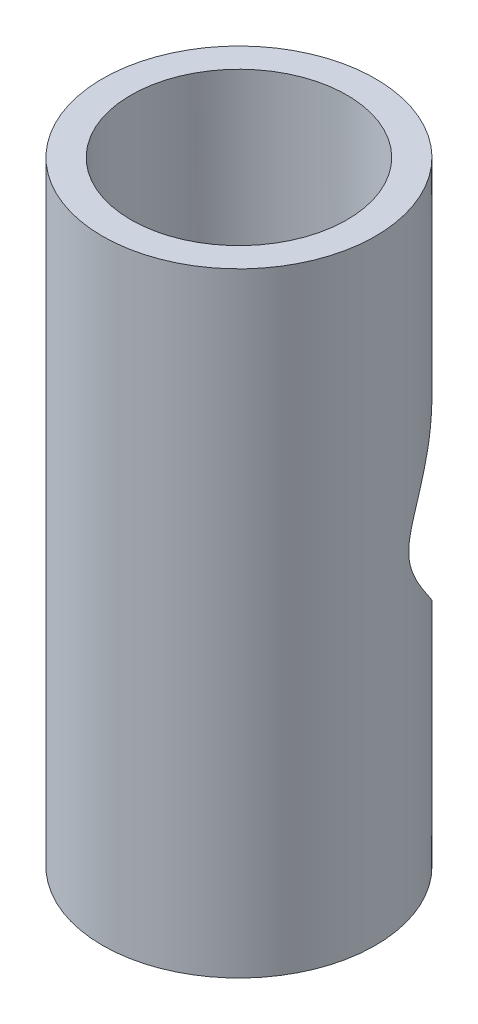
ISO-10303-21;
HEADER;
FILE_DESCRIPTION(('STEP AP214'),'2;1');
FILE_NAME('part.step','',(''),(''),'','','');
FILE_SCHEMA(('AUTOMOTIVE_DESIGN { 1 0 10303 214 1 1 1 1 }'));
ENDSEC;
DATA;
#1=APPLICATION_CONTEXT('core data for automotive mechanical design processes');
#2=APPLICATION_PROTOCOL_DEFINITION('international standard','automotive_design',2000,#1);
#3=PRODUCT_CONTEXT('',#1,'mechanical');
#4=PRODUCT('Part','Part','',(#3));
#5=PRODUCT_RELATED_PRODUCT_CATEGORY('part','',(#4));
#6=PRODUCT_DEFINITION_FORMATION('','',#4);
#7=PRODUCT_DEFINITION_CONTEXT('part definition',#1,'design');
#8=PRODUCT_DEFINITION('design','',#6,#7);
#9=PRODUCT_DEFINITION_SHAPE('','',#8);
#10=(LENGTH_UNIT() NAMED_UNIT(*) SI_UNIT(.MILLI.,.METRE.));
#11=(NAMED_UNIT(*) PLANE_ANGLE_UNIT() SI_UNIT($,.RADIAN.));
#12=(NAMED_UNIT(*) SI_UNIT($,.STERADIAN.) SOLID_ANGLE_UNIT());
#13=UNCERTAINTY_MEASURE_WITH_UNIT(LENGTH_MEASURE(1.E-05),#10,'distance_accuracy_value','');
#14=(GEOMETRIC_REPRESENTATION_CONTEXT(3) GLOBAL_UNCERTAINTY_ASSIGNED_CONTEXT((#13)) GLOBAL_UNIT_ASSIGNED_CONTEXT((#10,
#11,#12)) REPRESENTATION_CONTEXT('',''));
#15=CARTESIAN_POINT('',(0.,0.,0.));
#16=DIRECTION('',(0.,0.,1.));
#17=DIRECTION('',(1.,0.,0.));
#18=AXIS2_PLACEMENT_3D('',#15,#16,#17);
#19=CARTESIAN_POINT('',(0.,35.56,0.));
#20=DIRECTION('',(0.,0.,1.));
#21=DIRECTION('',(1.,0.,0.));
#22=AXIS2_PLACEMENT_3D('',#19,#20,#21);
#23=PLANE('',#22);
#24=CARTESIAN_POINT('',(0.,35.56,0.));
#25=DIRECTION('',(0.,0.,1.));
#26=DIRECTION('',(1.,0.,0.));
#27=AXIS2_PLACEMENT_3D('',#24,#25,#26);
#28=CIRCLE('',#27,14.605);
#29=CARTESIAN_POINT('',(12.065,27.329459313022,0.));
#30=VERTEX_POINT('',#29);
#31=CARTESIAN_POINT('',(12.065,43.790540686978,0.));
#32=VERTEX_POINT('',#31);
#33=EDGE_CURVE('E69',#30,#32,#28,.T.);
#34=ORIENTED_EDGE('',*,*,#33,.F.);
#35=DIRECTION('',(0.,1.,0.));
#36=VECTOR('',#35,1.);
#37=CARTESIAN_POINT('',(12.065,0.,0.));
#38=LINE('',#37,#36);
#39=EDGE_CURVE('E11',#30,#32,#38,.T.);
#40=ORIENTED_EDGE('',*,*,#39,.T.);
#41=EDGE_LOOP('',(#34,#40));
#42=FACE_BOUND('',#41,.T.);
#43=ADVANCED_FACE('F33',(#42),#23,.F.);
#44=CARTESIAN_POINT('',(0.,68.58,0.));
#45=DIRECTION('',(0.,-1.,0.));
#46=DIRECTION('',(0.,0.,-1.));
#47=AXIS2_PLACEMENT_3D('',#44,#45,#46);
#48=CYLINDRICAL_SURFACE('',#47,15.24);
#49=CARTESIAN_POINT('',(0.,50.165,-15.24));
#50=CARTESIAN_POINT('',(-0.33093358996792,50.1650006114282,-15.2400006098955));
#51=CARTESIAN_POINT('',(-0.661859114392725,50.1537321546418,-15.2292006371902));
#52=CARTESIAN_POINT('',(-1.32092860077811,50.1088938920169,-15.1862387463761));
#53=CARTESIAN_POINT('',(-1.6490713625311,50.0753149143057,-15.1540680427442));
#54=CARTESIAN_POINT('',(-2.3001816030391,49.9864801460235,-15.068999328301));
#55=CARTESIAN_POINT('',(-2.6231403970261,49.9311912739955,-15.0160696852406));
#56=CARTESIAN_POINT('',(-3.26090561073552,49.8000320933619,-14.8905918231387));
#57=CARTESIAN_POINT('',(-3.57571266261761,49.7241633859704,-14.8180451304031));
#58=CARTESIAN_POINT('',(-4.19302290448416,49.5537991184534,-14.6552843789313));
#59=CARTESIAN_POINT('',(-4.49559633720504,49.4594365229212,-14.5651964638999));
#60=CARTESIAN_POINT('',(-5.08918099996898,49.2532462643138,-14.3685631154736));
#61=CARTESIAN_POINT('',(-5.38019227015086,49.1414186618762,-14.2620177392181));
#62=CARTESIAN_POINT('',(-5.9494742292775,48.9018567148672,-14.034078405165));
#63=CARTESIAN_POINT('',(-6.22774707206366,48.7741250730736,-13.9126869704111));
#64=CARTESIAN_POINT('',(-6.77088193187832,48.5042338975543,-13.6566083422546));
#65=CARTESIAN_POINT('',(-7.03574083314454,48.3620710346042,-13.5219180810636));
#66=CARTESIAN_POINT('',(-7.65687437964201,48.0040358220291,-13.183358800626));
#67=CARTESIAN_POINT('',(-8.0063284355912,47.7817647509089,-12.9736953166482));
#68=CARTESIAN_POINT('',(-8.67712748313469,47.3150239977067,-12.5349835729407));
#69=CARTESIAN_POINT('',(-8.99846220972646,47.0705462748791,-12.3059282937458));
#70=CARTESIAN_POINT('',(-9.61385136234583,46.5618033257553,-11.8314324649711));
#71=CARTESIAN_POINT('',(-9.90783328059354,46.2974886842142,-11.5859511736049));
#72=CARTESIAN_POINT('',(-10.4680150205251,45.7521292294153,-11.0824234045809));
#73=CARTESIAN_POINT('',(-10.7342166822238,45.4710855261393,-10.8243777607807));
#74=CARTESIAN_POINT('',(-11.3226940237267,44.799182306733,-10.2121966169595));
#75=CARTESIAN_POINT('',(-11.6346181537817,44.4026049906728,-9.85436998927306));
#76=CARTESIAN_POINT('',(-12.2125302324538,43.5856377822277,-9.12835672832352));
#77=CARTESIAN_POINT('',(-12.4784863644511,43.1652316619513,-8.76016312294455));
#78=CARTESIAN_POINT('',(-12.8436329620918,42.5176069675765,-8.20655571719757));
#79=CARTESIAN_POINT('',(-12.9596524825016,42.2990443845405,-8.02192138759902));
#80=CARTESIAN_POINT('',(-13.1806591923973,41.8558397937468,-7.65336188136278));
#81=CARTESIAN_POINT('',(-13.2856475239992,41.6311984183922,-7.46943663321343));
#82=CARTESIAN_POINT('',(-13.484577984805,41.1755088272747,-7.10401272646018));
#83=CARTESIAN_POINT('',(-13.5785295660793,40.9444663062888,-6.92251211119802));
#84=CARTESIAN_POINT('',(-13.7554527822779,40.4749273176955,-6.56391844355129));
#85=CARTESIAN_POINT('',(-13.8384270848123,40.2364326785213,-6.38682432885911));
#86=CARTESIAN_POINT('',(-13.968559887674,39.8279627126289,-6.0953831887405));
#87=CARTESIAN_POINT('',(-14.0187054447384,39.6603729593842,-5.97902537089999));
#88=CARTESIAN_POINT('',(-14.1137010665404,39.3204033323164,-5.75119644853618));
#89=CARTESIAN_POINT('',(-14.158550910707,39.1480232593415,-5.63972554767859));
#90=CARTESIAN_POINT('',(-14.2427194724753,38.7978056740706,-5.42364828886364));
#91=CARTESIAN_POINT('',(-14.2820416426831,38.619971653659,-5.31903766793143));
#92=CARTESIAN_POINT('',(-14.3548362598628,38.257920672522,-5.11933500692725));
#93=CARTESIAN_POINT('',(-14.388310447351,38.073705630586,-5.02424013832465));
#94=CARTESIAN_POINT('',(-14.4606195166057,37.6254611447692,-4.812978036404));
#95=CARTESIAN_POINT('',(-14.4965526490508,37.3580203000021,-4.70280335608441));
#96=CARTESIAN_POINT('',(-14.5541023964824,36.8088707236599,-4.52161206344641));
#97=CARTESIAN_POINT('',(-14.5757639535185,36.527209817885,-4.45047264617915));
#98=CARTESIAN_POINT('',(-14.6004202004354,35.9986307750413,-4.3688633979901));
#99=CARTESIAN_POINT('',(-14.6057815696799,35.7530669527467,-4.35071915197012));
#100=CARTESIAN_POINT('',(-14.6040322655183,35.2626464919439,-4.35658672961078));
#101=CARTESIAN_POINT('',(-14.5969264292863,35.0177896160652,-4.38058220340708));
#102=CARTESIAN_POINT('',(-14.567127686787,34.4628842654013,-4.47878706769452));
#103=CARTESIAN_POINT('',(-14.5403843680251,34.1554155872073,-4.56594474087744));
#104=CARTESIAN_POINT('',(-14.4878515831048,33.7076708948459,-4.72895542089239));
#105=CARTESIAN_POINT('',(-14.4681961001991,33.560259582468,-4.78889162853409));
#106=CARTESIAN_POINT('',(-14.4250575613246,33.2697529028952,-4.91730705599512));
#107=CARTESIAN_POINT('',(-14.4015748897247,33.1266571039967,-4.98578541775431));
#108=CARTESIAN_POINT('',(-14.3420500197955,32.7942304421168,-5.1549811924488));
#109=CARTESIAN_POINT('',(-14.3045148666571,32.6066038246134,-5.25848855626441));
#110=CARTESIAN_POINT('',(-14.2233659902695,32.2377198110071,-5.47419116145263));
#111=CARTESIAN_POINT('',(-14.179749422577,32.0564654453434,-5.58639045730245));
#112=CARTESIAN_POINT('',(-14.086667986562,31.699178035174,-5.81711983060691));
#113=CARTESIAN_POINT('',(-14.0371939523673,31.5231537277935,-5.93565966664435));
#114=CARTESIAN_POINT('',(-13.9326235469992,31.1758362939618,-6.17713146868733));
#115=CARTESIAN_POINT('',(-13.8775262355038,31.0045439648953,-6.30006416702449));
#116=CARTESIAN_POINT('',(-13.7034603287959,30.4953716450805,-6.67446932821607));
#117=CARTESIAN_POINT('',(-13.5761152996926,30.1637039496309,-6.93054318968427));
#118=CARTESIAN_POINT('',(-13.2995588898553,29.5141704905745,-7.44751427686781));
#119=CARTESIAN_POINT('',(-13.1503658808353,29.1962934188881,-7.70840729070054));
#120=CARTESIAN_POINT('',(-12.7707800484125,28.4576361661028,-8.32709200305652));
#121=CARTESIAN_POINT('',(-12.5307117641263,28.0420438721826,-8.68520540154083));
#122=CARTESIAN_POINT('',(-12.0077933967209,27.2322669883791,-9.39495402322997));
#123=CARTESIAN_POINT('',(-11.7249190597921,26.8380947082109,-9.74658544624178));
#124=CARTESIAN_POINT('',(-11.1161181484147,26.0744583932655,-10.4355210297841));
#125=CARTESIAN_POINT('',(-10.7903547734142,25.7049083179713,-10.7728733960831));
#126=CARTESIAN_POINT('',(-10.0936173538025,24.9924618687501,-11.4282551422041));
#127=CARTESIAN_POINT('',(-9.72267306741963,24.6495481920532,-11.7462970361165));
#128=CARTESIAN_POINT('',(-9.07068600868019,24.108317119779,-12.2509871337507));
#129=CARTESIAN_POINT('',(-8.80284061992124,23.900963551186,-12.4450784553031));
#130=CARTESIAN_POINT('',(-8.24719330166416,23.5015230193319,-12.8200505425757));
#131=CARTESIAN_POINT('',(-7.95939299042078,23.3094348208227,-13.000932377089));
#132=CARTESIAN_POINT('',(-7.3642517334753,22.9427141976059,-13.3470526014911));
#133=CARTESIAN_POINT('',(-7.05692511783215,22.7680692082523,-13.5123022469135));
#134=CARTESIAN_POINT('',(-6.42316029761738,22.4383938426393,-13.8248098392735));
#135=CARTESIAN_POINT('',(-6.09672508184567,22.2833604108391,-13.9720705888132));
#136=CARTESIAN_POINT('',(-5.48157326441915,22.0192802214012,-14.2232660459294));
#137=CARTESIAN_POINT('',(-5.19557791511836,21.9068707950283,-14.3303359559968));
#138=CARTESIAN_POINT('',(-4.61219653450164,21.6989208688815,-14.5285961164503));
#139=CARTESIAN_POINT('',(-4.31481278072869,21.6033770174155,-14.6197895219211));
#140=CARTESIAN_POINT('',(-3.71017645606935,21.4306185002948,-14.7848010689248));
#141=CARTESIAN_POINT('',(-3.40292800160158,21.3533962992572,-14.8586263535644));
#142=CARTESIAN_POINT('',(-2.78028752769718,21.2185399184429,-14.9876170569265));
#143=CARTESIAN_POINT('',(-2.46489543887048,21.1609059056321,-15.0427823165946));
#144=CARTESIAN_POINT('',(-1.82649016613993,21.0660480029242,-15.1336060099284));
#145=CARTESIAN_POINT('',(-1.50344508472001,21.0289357113933,-15.1691577818923));
#146=CARTESIAN_POINT('',(-0.853980168746641,20.9763490027867,-15.2195398896823));
#147=CARTESIAN_POINT('',(-0.527560327195868,20.9608746305846,-15.2343701825353));
#148=CARTESIAN_POINT('',(0.125802002025864,20.9518884194293,-15.2429819047498));
#149=CARTESIAN_POINT('',(0.452744388109089,20.9583727330925,-15.2367670214389));
#150=CARTESIAN_POINT('',(1.10437801043874,20.9931602205076,-15.2034328766717));
#151=CARTESIAN_POINT('',(1.42906935329454,21.0214623537464,-15.1763146121181));
#152=CARTESIAN_POINT('',(2.0456153940353,21.0959266115426,-15.1049955583733));
#153=CARTESIAN_POINT('',(2.33788102869067,21.1403320722734,-15.0624753236671));
#154=CARTESIAN_POINT('',(2.91642810084928,21.2461276729626,-14.9612259067302));
#155=CARTESIAN_POINT('',(3.2027100847412,21.3075162547791,-14.9024982114786));
#156=CARTESIAN_POINT('',(3.76779176009528,21.4463736127632,-14.769753203915));
#157=CARTESIAN_POINT('',(4.04658945907832,21.5238466239394,-14.6957318648318));
#158=CARTESIAN_POINT('',(4.59535335145207,21.6938071579734,-14.5334868122793));
#159=CARTESIAN_POINT('',(4.86531786430913,21.7862975181877,-14.4452604149529));
#160=CARTESIAN_POINT('',(5.47777588056817,22.0160849194919,-14.2263010926811));
#161=CARTESIAN_POINT('',(5.81673391087698,22.1583736431338,-14.090879488995));
#162=CARTESIAN_POINT('',(6.4760616480858,22.4642438937979,-13.8002943370434));
#163=CARTESIAN_POINT('',(6.79642660051761,22.627830832642,-13.6451257713518));
#164=CARTESIAN_POINT('',(7.41789355169231,22.9739951979744,-13.3175058272436));
#165=CARTESIAN_POINT('',(7.71897620761218,23.1565912257873,-13.1450375263233));
#166=CARTESIAN_POINT('',(8.30108573359303,23.538386452783,-12.785408196861));
#167=CARTESIAN_POINT('',(8.58211193417357,23.7375862057139,-12.5982466782999));
#168=CARTESIAN_POINT('',(9.21877843046348,24.2228244437363,-12.1438675582518));
#169=CARTESIAN_POINT('',(9.56618769671643,24.5148888359268,-11.8715243634346));
#170=CARTESIAN_POINT('',(10.2249704997034,25.1217651175262,-11.3090808343598));
#171=CARTESIAN_POINT('',(10.5363284110377,25.4365867750943,-11.0189728831566));
#172=CARTESIAN_POINT('',(11.1248129448814,26.0870090295861,-10.4245659278919));
#173=CARTESIAN_POINT('',(11.4018213439768,26.4226757308257,-10.1202226212013));
#174=CARTESIAN_POINT('',(11.9213368029431,27.1116939381411,-9.502740818761));
#175=CARTESIAN_POINT('',(12.1638570440318,27.4650386175963,-9.18960573827651));
#176=CARTESIAN_POINT('',(12.6228676877402,28.200428813812,-8.54873747142967));
#177=CARTESIAN_POINT('',(12.8382639347854,28.5830327791477,-8.22085950731498));
#178=CARTESIAN_POINT('',(13.1354142285276,29.1713241400473,-7.73014976517637));
#179=CARTESIAN_POINT('',(13.2302018862682,29.3699738322743,-7.56664169164362));
#180=CARTESIAN_POINT('',(13.4111205415501,29.7723786817211,-7.2411379972595));
#181=CARTESIAN_POINT('',(13.4972523772012,29.9761333422552,-7.0791422313577));
#182=CARTESIAN_POINT('',(13.6605946784334,30.3886147401691,-6.75855062859438));
#183=CARTESIAN_POINT('',(13.7378338777834,30.5973226757388,-6.59994527168714));
#184=CARTESIAN_POINT('',(13.8836667357761,31.0212666989858,-6.28737810641545));
#185=CARTESIAN_POINT('',(13.9522579976957,31.2365045759816,-6.13341759429545));
#186=CARTESIAN_POINT('',(14.0804118435193,31.67413967744,-5.83319520051623));
#187=CARTESIAN_POINT('',(14.1399954177136,31.8965187463351,-5.68691595582481));
#188=CARTESIAN_POINT('',(14.2498865295353,32.3504394956559,-5.40564926307171));
#189=CARTESIAN_POINT('',(14.3002007875404,32.581974388874,-5.27065367331157));
#190=CARTESIAN_POINT('',(14.3760240575679,32.9788455810068,-5.05922510973082));
#191=CARTESIAN_POINT('',(14.4042691686236,33.1411220228946,-4.97805933679799));
#192=CARTESIAN_POINT('',(14.4558510310099,33.4713773317697,-4.82621840593951));
#193=CARTESIAN_POINT('',(14.4791868957293,33.6393572224503,-4.75554514364116));
#194=CARTESIAN_POINT('',(14.5202834475979,33.9799539522607,-4.62854350004338));
#195=CARTESIAN_POINT('',(14.5380851727736,34.1525258280136,-4.57211014273308));
#196=CARTESIAN_POINT('',(14.5677509052526,34.5028431355706,-4.47668570167877));
#197=CARTESIAN_POINT('',(14.5796196482622,34.6805843209196,-4.43768070926237));
#198=CARTESIAN_POINT('',(14.6002594632861,35.1113960114168,-4.36943720307472));
#199=CARTESIAN_POINT('',(14.6059298024599,35.3663568764821,-4.35022461469735));
#200=CARTESIAN_POINT('',(14.6038153072817,35.8756714444144,-4.35731180950827));
#201=CARTESIAN_POINT('',(14.5960187757367,36.1300244270925,-4.38365115869121));
#202=CARTESIAN_POINT('',(14.5639448556157,36.7004166805889,-4.48917140755685));
#203=CARTESIAN_POINT('',(14.5356648036173,37.0137916927865,-4.58108064592162));
#204=CARTESIAN_POINT('',(14.4804262508952,37.4697315617419,-4.75167847727976));
#205=CARTESIAN_POINT('',(14.4598011885345,37.6197572888245,-4.8142212569889));
#206=CARTESIAN_POINT('',(14.4145995198159,37.915339964965,-4.94791907138091));
#207=CARTESIAN_POINT('',(14.3900233221398,38.0608973743467,-5.01907321516781));
#208=CARTESIAN_POINT('',(14.3276358852768,38.399793104497,-5.19499806269882));
#209=CARTESIAN_POINT('',(14.288254534642,38.5913485058723,-5.30261202642988));
#210=CARTESIAN_POINT('',(14.2031490897069,38.9679076262537,-5.52653012052104));
#211=CARTESIAN_POINT('',(14.1574220564609,39.1529082593519,-5.64283826593139));
#212=CARTESIAN_POINT('',(14.059852516876,39.5175563453709,-5.8817361596382));
#213=CARTESIAN_POINT('',(14.0080005438169,39.6971949595095,-6.00433546170536));
#214=CARTESIAN_POINT('',(13.8984045805172,40.0516319039087,-6.25384356596224));
#215=CARTESIAN_POINT('',(13.8406596243949,40.2264294347094,-6.38075307232872));
#216=CARTESIAN_POINT('',(13.6582435073136,40.7459145228067,-6.76690776366138));
#217=CARTESIAN_POINT('',(13.5247826795328,41.0842480476351,-7.03060068800712));
#218=CARTESIAN_POINT('',(13.2348416199294,41.7467129651719,-7.56230536311808));
#219=CARTESIAN_POINT('',(13.0783806111917,42.0708559272672,-7.83031334247458));
#220=CARTESIAN_POINT('',(12.6884227823554,42.8081107220232,-8.45195807879015));
#221=CARTESIAN_POINT('',(12.446268985734,43.2166401520238,-8.80565333062447));
#222=CARTESIAN_POINT('',(11.9199804807256,44.0126735144586,-9.50599015725437));
#223=CARTESIAN_POINT('',(11.6358233044845,44.4001660415141,-9.85262784331142));
#224=CARTESIAN_POINT('',(11.0252709915153,45.1507565730016,-10.5313170084682));
#225=CARTESIAN_POINT('',(10.699032794552,45.5139379610738,-10.8634168329192));
#226=CARTESIAN_POINT('',(10.0022271495844,46.2138745625219,-11.5081775874024));
#227=CARTESIAN_POINT('',(9.63168817457687,46.5506465217009,-11.8208508089771));
#228=CARTESIAN_POINT('',(8.9799705631898,47.0829155562331,-12.3176074829058));
#229=CARTESIAN_POINT('',(8.71162166613813,47.2873106091613,-12.5090704763686));
#230=CARTESIAN_POINT('',(8.15522836127501,47.6808228640778,-12.8787173390171));
#231=CARTESIAN_POINT('',(7.86718545290582,47.8699412268007,-13.0569022170043));
#232=CARTESIAN_POINT('',(7.27176676407537,48.2307758524934,-13.3976347434216));
#233=CARTESIAN_POINT('',(6.96439941560723,48.4024996211488,-13.5601891347841));
#234=CARTESIAN_POINT('',(6.33088109527241,48.7263376493064,-13.8672773205957));
#235=CARTESIAN_POINT('',(6.00473347935999,48.8784553966856,-14.0118143201569));
#236=CARTESIAN_POINT('',(5.38953888678302,49.1376068744199,-14.2583893288909));
#237=CARTESIAN_POINT('',(5.10311946626025,49.24794705931,-14.3635138306228));
#238=CARTESIAN_POINT('',(4.51909060704993,49.4517043765002,-14.5578186649785));
#239=CARTESIAN_POINT('',(4.22148337506244,49.5451248251439,-14.647002122073));
#240=CARTESIAN_POINT('',(3.61703422501124,49.7134917397333,-14.8078453938045));
#241=CARTESIAN_POINT('',(3.31020939700566,49.7884702807189,-14.879535631729));
#242=CARTESIAN_POINT('',(2.68881494587495,49.9188661981048,-15.0042744826717));
#243=CARTESIAN_POINT('',(2.37424828513302,49.9742909359298,-15.0573301110319));
#244=CARTESIAN_POINT('',(1.71841617363772,50.0675804539604,-15.1466587609065));
#245=CARTESIAN_POINT('',(1.37676367508864,50.1040368077294,-15.1815853332441));
#246=CARTESIAN_POINT('',(0.690071707463849,50.1527490738189,-15.2282583281138));
#247=CARTESIAN_POINT('',(0.345031470046944,50.1649993625248,-15.2399993641227));
#248=CARTESIAN_POINT('',(0.,50.165,-15.24));
#249=B_SPLINE_CURVE_WITH_KNOTS('',3,(#49,#50,#51,#52,#53,#54,#55,#56,#57,#58,#59,#60,#61,#62,
#63,#64,#65,#66,#67,#68,#69,#70,#71,#72,#73,#74,#75,#76,#77,#78,#79,#80,#81,#82,#83,#84,#85,#86,
#87,#88,#89,#90,#91,#92,#93,#94,#95,#96,#97,#98,#99,#100,#101,#102,#103,#104,#105,#106,#107,
#108,#109,#110,#111,#112,#113,#114,#115,#116,#117,#118,#119,#120,#121,#122,#123,#124,#125,#126,
#127,#128,#129,#130,#131,#132,#133,#134,#135,#136,#137,#138,#139,#140,#141,#142,#143,#144,#145,
#146,#147,#148,#149,#150,#151,#152,#153,#154,#155,#156,#157,#158,#159,#160,#161,#162,#163,#164,
#165,#166,#167,#168,#169,#170,#171,#172,#173,#174,#175,#176,#177,#178,#179,#180,#181,#182,#183,
#184,#185,#186,#187,#188,#189,#190,#191,#192,#193,#194,#195,#196,#197,#198,#199,#200,#201,#202,
#203,#204,#205,#206,#207,#208,#209,#210,#211,#212,#213,#214,#215,#216,#217,#218,#219,#220,#221,
#222,#223,#224,#225,#226,#227,#228,#229,#230,#231,#232,#233,#234,#235,#236,#237,#238,#239,#240,
#241,#242,#243,#244,#245,#246,#247,#248),.UNSPECIFIED.,.T.,.F.,(4,2,2,2,2,2,2,2,2,2,2,2,2,2,2,2,
2,2,2,2,2,2,2,2,2,2,2,2,2,2,2,2,2,2,2,2,2,2,2,2,2,2,2,2,2,2,2,2,2,2,2,2,2,2,2,2,2,2,2,2,2,2,2,2,
2,2,2,2,2,2,2,2,2,2,2,2,2,2,2,2,2,2,2,2,2,2,2,2,2,2,2,2,2,2,2,2,2,2,2,4),(0.,0.992423124866251,
1.98525448829752,2.97960463236791,3.9738774332082,4.96124795361828,5.94861504600721,
6.9358145708496,7.92324235844028,9.31376813640987,10.7047994285211,12.0994188926311,
13.4939459259435,15.3471079884006,17.2015476194857,18.1275590824708,19.0534745760426,
19.9785912269762,20.9034826489236,21.5336238938732,22.1637913754896,22.7935634863738,
23.4231478396975,24.2952425676331,25.1645777209902,25.8996212724154,26.6343796959994,
27.5904628686862,28.0712903590484,28.5520695890817,29.2042524636666,29.8567414116966,
30.5102652278199,31.1638985055262,32.476718304446,33.7884404407515,35.5829568524212,
37.3784938665097,39.167386056525,40.9551063073844,42.1253986814265,43.2955962607553,
44.4649447535711,45.6341108333231,46.6094057716358,47.5845066710554,48.5592058301721,
49.5339132972247,50.5138704246527,51.493829584357,52.4736170541971,53.4533577999059,
54.3483505000537,55.2432611149687,56.1384076581624,57.033723526298,58.2073018606971,
59.3811789824726,60.556215794688,61.7312918110685,63.3168758288079,64.9031445190421,
66.4947295846593,68.0857047093361,69.7280825562334,70.5505108921948,71.3728595187142,
72.1924716241721,73.0123103831332,73.8302082347742,74.6475107456517,75.1980451921378,
75.7486789800988,76.295126415901,76.8411369780985,77.60392841693,78.3673827422083,
79.344558373181,79.835901857549,80.3271945529437,80.9963794096949,81.6658752342052,
82.3364197165413,83.0070742806565,84.3537401963848,85.6992869285882,87.4738158415305,
89.249297418491,91.018339141093,92.7862499164462,93.9489833727297,95.1116284003853,
96.2737695957717,97.4357037620573,98.4080825590798,99.3802705587832,100.350755532804,
101.320874757278,102.355335134355,103.390035811655),.UNSPECIFIED.);
#250=CARTESIAN_POINT('',(0.,50.165,-15.24));
#251=VERTEX_POINT('',#250);
#252=EDGE_CURVE('E72',#251,#251,#249,.T.);
#253=ORIENTED_EDGE('',*,*,#252,.T.);
#254=EDGE_LOOP('',(#253));
#255=FACE_BOUND('',#254,.T.);
#256=CARTESIAN_POINT('',(0.,68.58,0.));
#257=DIRECTION('',(0.,1.,0.));
#258=DIRECTION('',(0.,0.,1.));
#259=AXIS2_PLACEMENT_3D('',#256,#257,#258);
#260=CIRCLE('',#259,15.24);
#261=CARTESIAN_POINT('',(0.,68.58,15.24));
#262=VERTEX_POINT('',#261);
#263=EDGE_CURVE('E62',#262,#262,#260,.T.);
#264=ORIENTED_EDGE('',*,*,#263,.F.);
#265=EDGE_LOOP('',(#264));
#266=FACE_BOUND('',#265,.T.);
#267=CARTESIAN_POINT('',(0.,0.,0.));
#268=DIRECTION('',(0.,1.,0.));
#269=DIRECTION('',(0.,0.,1.));
#270=AXIS2_PLACEMENT_3D('',#267,#268,#269);
#271=CIRCLE('',#270,15.24);
#272=CARTESIAN_POINT('',(0.,0.,15.24));
#273=VERTEX_POINT('',#272);
#274=EDGE_CURVE('E75',#273,#273,#271,.T.);
#275=ORIENTED_EDGE('',*,*,#274,.T.);
#276=EDGE_LOOP('',(#275));
#277=FACE_BOUND('',#276,.T.);
#278=ADVANCED_FACE('F35',(#255,#266,#277),#48,.T.);
#279=CARTESIAN_POINT('',(0.,68.58,0.));
#280=DIRECTION('',(0.,1.,0.));
#281=DIRECTION('',(0.,0.,1.));
#282=AXIS2_PLACEMENT_3D('',#279,#280,#281);
#283=PLANE('',#282);
#284=CARTESIAN_POINT('',(0.,68.58,0.));
#285=DIRECTION('',(0.,1.,0.));
#286=DIRECTION('',(0.,0.,1.));
#287=AXIS2_PLACEMENT_3D('',#284,#285,#286);
#288=CIRCLE('',#287,12.065);
#289=CARTESIAN_POINT('',(0.,68.58,12.065));
#290=VERTEX_POINT('',#289);
#291=EDGE_CURVE('E102',#290,#290,#288,.T.);
#292=ORIENTED_EDGE('',*,*,#291,.F.);
#293=EDGE_LOOP('',(#292));
#294=FACE_BOUND('',#293,.T.);
#295=ORIENTED_EDGE('',*,*,#263,.T.);
#296=EDGE_LOOP('',(#295));
#297=FACE_BOUND('',#296,.T.);
#298=ADVANCED_FACE('F94',(#294,#297),#283,.T.);
#299=CARTESIAN_POINT('',(0.,0.,0.));
#300=DIRECTION('',(0.,1.,0.));
#301=DIRECTION('',(0.,0.,1.));
#302=AXIS2_PLACEMENT_3D('',#299,#300,#301);
#303=PLANE('',#302);
#304=CARTESIAN_POINT('',(0.,0.,0.));
#305=DIRECTION('',(0.,1.,0.));
#306=DIRECTION('',(0.,0.,1.));
#307=AXIS2_PLACEMENT_3D('',#304,#305,#306);
#308=CIRCLE('',#307,12.065);
#309=CARTESIAN_POINT('',(0.,0.,12.065));
#310=VERTEX_POINT('',#309);
#311=EDGE_CURVE('E101',#310,#310,#308,.T.);
#312=ORIENTED_EDGE('',*,*,#311,.T.);
#313=EDGE_LOOP('',(#312));
#314=FACE_BOUND('',#313,.T.);
#315=ORIENTED_EDGE('',*,*,#274,.F.);
#316=EDGE_LOOP('',(#315));
#317=FACE_BOUND('',#316,.T.);
#318=ADVANCED_FACE('F93',(#314,#317),#303,.F.);
#319=CARTESIAN_POINT('',(0.,35.56,-68.58));
#320=DIRECTION('',(0.,0.,1.));
#321=DIRECTION('',(1.,0.,0.));
#322=AXIS2_PLACEMENT_3D('',#319,#320,#321);
#323=CYLINDRICAL_SURFACE('',#322,14.605);
#324=ORIENTED_EDGE('',*,*,#33,.T.);
#325=CARTESIAN_POINT('',(12.065,43.790540686978,0.));
#326=CARTESIAN_POINT('',(12.0650019386063,43.7905337377618,-0.109289002990185));
#327=CARTESIAN_POINT('',(12.0635145864306,43.7927185694541,-0.218560477734938));
#328=CARTESIAN_POINT('',(12.0575831173803,43.801404945241,-0.436836779796077));
#329=CARTESIAN_POINT('',(12.0531394049616,43.8079058988522,-0.5458416415403));
#330=CARTESIAN_POINT('',(12.035430529017,43.8337475624667,-0.871699394198455));
#331=CARTESIAN_POINT('',(12.0177874287179,43.8594276392924,-1.08785386003908));
#332=CARTESIAN_POINT('',(11.9715985437103,43.9259094942832,-1.51335143174753));
#333=CARTESIAN_POINT('',(11.9432128585718,43.9664889699453,-1.72274777025183));
#334=CARTESIAN_POINT('',(11.8761095908286,44.0610235036505,-2.13688667833171));
#335=CARTESIAN_POINT('',(11.8373864326827,44.1149857786205,-2.34162667163581));
#336=CARTESIAN_POINT('',(11.7333527509459,44.2574100170578,-2.82398808737715));
#337=CARTESIAN_POINT('',(11.663554939986,44.3511361435018,-3.09908825190185));
#338=CARTESIAN_POINT('',(11.5068777655726,44.5552392125257,-3.63796958622529));
#339=CARTESIAN_POINT('',(11.4199917424248,44.6656226429488,-3.90174629401227));
#340=CARTESIAN_POINT('',(11.2296524255947,44.8993690969458,-4.41994364713246));
#341=CARTESIAN_POINT('',(11.1260769788821,45.0228253235898,-4.67427684351055));
#342=CARTESIAN_POINT('',(10.9037434133303,45.2781838649929,-5.17173318533215));
#343=CARTESIAN_POINT('',(10.784985526966,45.4100860504113,-5.41485650234482));
#344=CARTESIAN_POINT('',(10.4795665844919,45.7361200613639,-5.99078679576343));
#345=CARTESIAN_POINT('',(10.2854149442554,45.9329993340883,-6.31808794130988));
#346=CARTESIAN_POINT('',(9.86835959425261,46.330545116976,-6.95151159458267));
#347=CARTESIAN_POINT('',(9.64544422447804,46.5312131346734,-7.25762543582842));
#348=CARTESIAN_POINT('',(9.17169557940453,46.9302136309035,-7.84774282659168));
#349=CARTESIAN_POINT('',(8.92092196513102,47.1285501317274,-8.13179149410926));
#350=CARTESIAN_POINT('',(8.39120965632352,47.5183323380438,-8.67734289103072));
#351=CARTESIAN_POINT('',(8.11228138129676,47.7097805574371,-8.93885389525861));
#352=CARTESIAN_POINT('',(7.58746431181984,48.0424603821617,-9.3854831142173));
#353=CARTESIAN_POINT('',(7.34680811300581,48.185841000169,-9.575162444572));
#354=CARTESIAN_POINT('',(6.84815018269782,48.4631084297732,-9.93791160837423));
#355=CARTESIAN_POINT('',(6.59015196300219,48.5969971522845,-10.1109847874763));
#356=CARTESIAN_POINT('',(6.05752101140254,48.8528427335574,-10.4387905991576));
#357=CARTESIAN_POINT('',(5.7829053174038,48.9748114891551,-10.5935415517272));
#358=CARTESIAN_POINT('',(5.21766520928489,49.2045962668698,-10.8830584610088));
#359=CARTESIAN_POINT('',(4.92704365891869,49.3124148091276,-11.0178279769536));
#360=CARTESIAN_POINT('',(4.38195365545968,49.4945771707019,-11.2443032244717));
#361=CARTESIAN_POINT('',(4.12976440492252,49.5714943862034,-11.3394337829361));
#362=CARTESIAN_POINT('',(3.61641523886107,49.7126814572319,-11.5134347665188));
#363=CARTESIAN_POINT('',(3.35525712755364,49.7769538391491,-11.592308439852));
#364=CARTESIAN_POINT('',(2.82543193796835,49.8916570326109,-11.7326992284867));
#365=CARTESIAN_POINT('',(2.55676769825327,49.9420930005961,-11.794222809917));
#366=CARTESIAN_POINT('',(2.01354342456516,50.0281471412224,-11.8990073675105));
#367=CARTESIAN_POINT('',(1.73898332219922,50.0637651418749,-11.9422681317018));
#368=CARTESIAN_POINT('',(1.18482718572034,50.1195353132174,-12.0099391435513));
#369=CARTESIAN_POINT('',(0.90521512646827,50.1396235138834,-12.0342714239441));
#370=CARTESIAN_POINT('',(0.344276455871656,50.1636400250984,-12.0633564839156));
#371=CARTESIAN_POINT('',(0.0629498409706401,50.1675683021156,-12.0681092228669));
#372=CARTESIAN_POINT('',(-0.499094847971048,50.1591753974975,-12.0579488375391));
#373=CARTESIAN_POINT('',(-0.779812936449698,50.1468546057115,-12.0430361850742));
#374=CARTESIAN_POINT('',(-1.33836352389273,50.1062438989632,-11.9938152826836));
#375=CARTESIAN_POINT('',(-1.61619611417958,50.0779544909659,-11.9595076485019));
#376=CARTESIAN_POINT('',(-2.14909106692495,50.0083540288199,-11.8749177126927));
#377=CARTESIAN_POINT('',(-2.40446685833957,49.9679997929378,-11.8258075645196));
#378=CARTESIAN_POINT('',(-2.90928844452818,49.8746063663464,-11.7118410984488));
#379=CARTESIAN_POINT('',(-3.15873454860694,49.8215678388792,-11.6469856038485));
#380=CARTESIAN_POINT('',(-3.65039638987587,49.7037104710933,-11.5023693734811));
#381=CARTESIAN_POINT('',(-3.89261212827205,49.6388916327395,-11.4226086402003));
#382=CARTESIAN_POINT('',(-4.36883814899336,49.498469758603,-11.2490772109386));
#383=CARTESIAN_POINT('',(-4.60284537459846,49.4228627574936,-11.1553013629203));
#384=CARTESIAN_POINT('',(-5.08191994287746,49.2548925373496,-10.9458910277842));
#385=CARTESIAN_POINT('',(-5.32615193960103,49.1616406757057,-10.8290598072791));
#386=CARTESIAN_POINT('',(-5.80314706925638,48.9650770736789,-10.5811154277822));
#387=CARTESIAN_POINT('',(-6.0359054452004,48.8617612127023,-10.4499964161825));
#388=CARTESIAN_POINT('',(-6.48934294968226,48.6465364331581,-10.1746260693733));
#389=CARTESIAN_POINT('',(-6.71002203054006,48.5346274806756,-10.0303746823329));
#390=CARTESIAN_POINT('',(-7.13900734494767,48.3036245081549,-9.72971857050974));
#391=CARTESIAN_POINT('',(-7.34731184233867,48.1845294846107,-9.57331214744274));
#392=CARTESIAN_POINT('',(-7.7932936664825,47.9152334772622,-9.21556372012988));
#393=CARTESIAN_POINT('',(-8.0280964469135,47.7637059837203,-9.01163206608847));
#394=CARTESIAN_POINT('',(-8.47926751921727,47.4546556804114,-8.58847687954628));
#395=CARTESIAN_POINT('',(-8.69563302413683,47.2971319694524,-8.36925104427456));
#396=CARTESIAN_POINT('',(-9.11017823857308,46.9783681415461,-7.91601792803009));
#397=CARTESIAN_POINT('',(-9.30833054486567,46.8171228668858,-7.68198923996046));
#398=CARTESIAN_POINT('',(-9.68602211396163,46.4938362624363,-7.19992821283715));
#399=CARTESIAN_POINT('',(-9.86556279533923,46.3317949943049,-6.95189694328646));
#400=CARTESIAN_POINT('',(-10.204137169787,46.011570653432,-6.44452247263551));
#401=CARTESIAN_POINT('',(-10.3633623980942,45.8533650522448,-6.18532147412939));
#402=CARTESIAN_POINT('',(-10.6630872678472,45.542544655557,-5.65297715665887));
#403=CARTESIAN_POINT('',(-10.8035827381756,45.3899311108765,-5.37983075072029));
#404=CARTESIAN_POINT('',(-11.0648918006495,45.0948286731212,-4.81951833211362));
#405=CARTESIAN_POINT('',(-11.1857339868193,44.9523252440363,-4.5323734917868));
#406=CARTESIAN_POINT('',(-11.4066707666236,44.6827320750777,-3.94348324007253));
#407=CARTESIAN_POINT('',(-11.5067786285413,44.5556324997292,-3.64174731924706));
#408=CARTESIAN_POINT('',(-11.710155450207,44.2900513687097,-2.93390567014762));
#409=CARTESIAN_POINT('',(-11.8060560741409,44.1588060293141,-2.52273730016325));
#410=CARTESIAN_POINT('',(-11.9177702909438,44.002563206319,-1.89119429103136));
#411=CARTESIAN_POINT('',(-11.9496293333657,43.9572893028803,-1.67853223879853));
#412=CARTESIAN_POINT('',(-12.0021014506186,43.8821213480306,-1.24917891170596));
#413=CARTESIAN_POINT('',(-12.0227218744358,43.8522172469635,-1.03249036589634));
#414=CARTESIAN_POINT('',(-12.0466090752426,43.8174507090233,-0.679546369838723));
#415=CARTESIAN_POINT('',(-12.0534927525403,43.8073904492511,-0.544021368567095));
#416=CARTESIAN_POINT('',(-12.0626937945112,43.7939215837596,-0.272340388881337));
#417=CARTESIAN_POINT('',(-12.0650061916414,43.7905202141974,-0.136183885033622));
#418=CARTESIAN_POINT('',(-12.065,43.790540686978,0.));
#419=B_SPLINE_CURVE_WITH_KNOTS('',3,(#325,#326,#327,#328,#329,#330,#331,#332,#333,#334,#335,
#336,#337,#338,#339,#340,#341,#342,#343,#344,#345,#346,#347,#348,#349,#350,#351,#352,#353,#354,
#355,#356,#357,#358,#359,#360,#361,#362,#363,#364,#365,#366,#367,#368,#369,#370,#371,#372,#373,
#374,#375,#376,#377,#378,#379,#380,#381,#382,#383,#384,#385,#386,#387,#388,#389,#390,#391,#392,
#393,#394,#395,#396,#397,#398,#399,#400,#401,#402,#403,#404,#405,#406,#407,#408,#409,#410,#411,
#412,#413,#414,#415,#416,#417,#418),.UNSPECIFIED.,.F.,.F.,(4,2,2,2,2,2,2,2,2,2,2,2,2,2,2,2,2,2,
2,2,2,2,2,2,2,2,2,2,2,2,2,2,2,2,2,2,2,2,2,2,2,2,2,2,2,2,4),(0.,0.327801199390472,
0.655557561941936,1.30970075686984,1.95445625518129,2.59956020899771,3.49479091277897,
4.39037120370188,5.29283196996464,6.19527891931996,7.47899524513798,8.76323359800837,
10.0447728086343,11.3258394727159,12.3398700895585,13.3536959779639,14.3664994467844,
15.3791222906864,16.2191755824874,17.0590608639727,17.898632717423,18.7382143153011,
19.5812361401694,20.4242597142994,21.2672630628876,22.1102396496502,22.8988831304205,
23.6874853832425,24.4760875045265,25.2649802368337,26.1232033796455,26.981779401376,
27.8403588118802,28.699058398291,29.7359471442185,30.772992347819,31.8115731671281,
32.8500747677262,33.8779192828857,34.9059923180127,35.9325559392773,36.958460599648,
38.2793620839453,38.9379156896978,39.5960381458644,40.0040334608714,40.4124718952164),.UNSPECIFIED.);
#420=CARTESIAN_POINT('',(-12.065,43.790540686978,0.));
#421=VERTEX_POINT('',#420);
#422=EDGE_CURVE('E54',#32,#421,#419,.T.);
#423=ORIENTED_EDGE('',*,*,#422,.T.);
#424=CARTESIAN_POINT('',(-12.065,27.329459313022,0.));
#425=VERTEX_POINT('',#424);
#426=EDGE_CURVE('E67',#421,#425,#28,.T.);
#427=ORIENTED_EDGE('',*,*,#426,.T.);
#428=CARTESIAN_POINT('',(-12.065,27.329459313022,0.));
#429=CARTESIAN_POINT('',(-12.0650019386063,27.3294662622382,-0.109289002990185));
#430=CARTESIAN_POINT('',(-12.0635145864306,27.3272814305459,-0.218560477734939));
#431=CARTESIAN_POINT('',(-12.0575831173803,27.318595054759,-0.436836779796077));
#432=CARTESIAN_POINT('',(-12.0531394049616,27.3120941011478,-0.5458416415403));
#433=CARTESIAN_POINT('',(-12.035430529017,27.2862524375333,-0.871699394198455));
#434=CARTESIAN_POINT('',(-12.0177874287179,27.2605723607076,-1.08785386003908));
#435=CARTESIAN_POINT('',(-11.9715985437103,27.1940905057168,-1.51335143174753));
#436=CARTESIAN_POINT('',(-11.9432128585718,27.1535110300547,-1.72274777025183));
#437=CARTESIAN_POINT('',(-11.8761095908286,27.0589764963495,-2.13688667833171));
#438=CARTESIAN_POINT('',(-11.8373864326827,27.0050142213795,-2.34162667163581));
#439=CARTESIAN_POINT('',(-11.7333527509459,26.8625899829421,-2.82398808737715));
#440=CARTESIAN_POINT('',(-11.663554939986,26.7688638564982,-3.09908825190185));
#441=CARTESIAN_POINT('',(-11.5068777655726,26.5647607874742,-3.63796958622529));
#442=CARTESIAN_POINT('',(-11.4199917424248,26.4543773570512,-3.90174629401227));
#443=CARTESIAN_POINT('',(-11.2296524255947,26.2206309030542,-4.41994364713247));
#444=CARTESIAN_POINT('',(-11.1260769788821,26.0971746764102,-4.67427684351055));
#445=CARTESIAN_POINT('',(-10.9037434133303,25.8418161350071,-5.17173318533215));
#446=CARTESIAN_POINT('',(-10.784985526966,25.7099139495887,-5.41485650234482));
#447=CARTESIAN_POINT('',(-10.4795665844919,25.3838799386361,-5.99078679576343));
#448=CARTESIAN_POINT('',(-10.2854149442554,25.1870006659117,-6.31808794130988));
#449=CARTESIAN_POINT('',(-9.8683595942526,24.789454883024,-6.95151159458267));
#450=CARTESIAN_POINT('',(-9.64544422447804,24.5887868653266,-7.25762543582842));
#451=CARTESIAN_POINT('',(-9.17169557940453,24.1897863690965,-7.84774282659168));
#452=CARTESIAN_POINT('',(-8.92092196513102,23.9914498682726,-8.13179149410925));
#453=CARTESIAN_POINT('',(-8.39120965632352,23.6016676619562,-8.67734289103072));
#454=CARTESIAN_POINT('',(-8.11228138129676,23.4102194425629,-8.93885389525861));
#455=CARTESIAN_POINT('',(-7.58746431181984,23.0775396178383,-9.38548311421729));
#456=CARTESIAN_POINT('',(-7.34680811300581,22.934158999831,-9.575162444572));
#457=CARTESIAN_POINT('',(-6.84815018269782,22.6568915702268,-9.93791160837423));
#458=CARTESIAN_POINT('',(-6.59015196300219,22.5230028477155,-10.1109847874763));
#459=CARTESIAN_POINT('',(-6.05752101140255,22.2671572664426,-10.4387905991576));
#460=CARTESIAN_POINT('',(-5.7829053174038,22.1451885108449,-10.5935415517271));
#461=CARTESIAN_POINT('',(-5.2176652092849,21.9154037331302,-10.8830584610088));
#462=CARTESIAN_POINT('',(-4.92704365891869,21.8075851908724,-11.0178279769536));
#463=CARTESIAN_POINT('',(-4.38195365545968,21.6254228292981,-11.2443032244717));
#464=CARTESIAN_POINT('',(-4.12976440492252,21.5485056137966,-11.3394337829361));
#465=CARTESIAN_POINT('',(-3.61641523886107,21.4073185427681,-11.5134347665188));
#466=CARTESIAN_POINT('',(-3.35525712755365,21.3430461608509,-11.592308439852));
#467=CARTESIAN_POINT('',(-2.82543193796835,21.2283429673891,-11.7326992284867));
#468=CARTESIAN_POINT('',(-2.55676769825327,21.1779069994039,-11.794222809917));
#469=CARTESIAN_POINT('',(-2.01354342456516,21.0918528587776,-11.8990073675105));
#470=CARTESIAN_POINT('',(-1.73898332219922,21.056234858125,-11.9422681317018));
#471=CARTESIAN_POINT('',(-1.18482718572034,21.0004646867826,-12.0099391435513));
#472=CARTESIAN_POINT('',(-0.905215126468272,20.9803764861165,-12.0342714239441));
#473=CARTESIAN_POINT('',(-0.344276455871659,20.9563599749016,-12.0633564839156));
#474=CARTESIAN_POINT('',(-0.0629498409706429,20.9524316978844,-12.0681092228669));
#475=CARTESIAN_POINT('',(0.499094847971044,20.9608246025025,-12.0579488375391));
#476=CARTESIAN_POINT('',(0.779812936449695,20.9731453942885,-12.0430361850742));
#477=CARTESIAN_POINT('',(1.33836352389273,21.0137561010368,-11.9938152826836));
#478=CARTESIAN_POINT('',(1.61619611417958,21.042045509034,-11.9595076485019));
#479=CARTESIAN_POINT('',(2.14909106692495,21.1116459711801,-11.8749177126927));
#480=CARTESIAN_POINT('',(2.40446685833956,21.1520002070622,-11.8258075645196));
#481=CARTESIAN_POINT('',(2.90928844452817,21.2453936336536,-11.7118410984488));
#482=CARTESIAN_POINT('',(3.15873454860694,21.2984321611208,-11.6469856038485));
#483=CARTESIAN_POINT('',(3.65039638987587,21.4162895289067,-11.5023693734811));
#484=CARTESIAN_POINT('',(3.89261212827204,21.4811083672605,-11.4226086402003));
#485=CARTESIAN_POINT('',(4.36883814899335,21.621530241397,-11.2490772109386));
#486=CARTESIAN_POINT('',(4.60284537459845,21.6971372425064,-11.1553013629203));
#487=CARTESIAN_POINT('',(5.08191994287746,21.8651074626504,-10.9458910277842));
#488=CARTESIAN_POINT('',(5.32615193960102,21.9583593242942,-10.8290598072791));
#489=CARTESIAN_POINT('',(5.80314706925638,22.1549229263211,-10.5811154277822));
#490=CARTESIAN_POINT('',(6.03590544520039,22.2582387872977,-10.4499964161825));
#491=CARTESIAN_POINT('',(6.48934294968226,22.4734635668419,-10.1746260693733));
#492=CARTESIAN_POINT('',(6.71002203054006,22.5853725193244,-10.0303746823329));
#493=CARTESIAN_POINT('',(7.13900734494767,22.8163754918451,-9.72971857050974));
#494=CARTESIAN_POINT('',(7.34731184233867,22.9354705153893,-9.57331214744274));
#495=CARTESIAN_POINT('',(7.7932936664825,23.2047665227378,-9.21556372012988));
#496=CARTESIAN_POINT('',(8.0280964469135,23.3562940162797,-9.01163206608846));
#497=CARTESIAN_POINT('',(8.47926751921728,23.6653443195885,-8.58847687954627));
#498=CARTESIAN_POINT('',(8.69563302413683,23.8228680305476,-8.36925104427456));
#499=CARTESIAN_POINT('',(9.11017823857308,24.1416318584539,-7.91601792803009));
#500=CARTESIAN_POINT('',(9.30833054486567,24.3028771331141,-7.68198923996046));
#501=CARTESIAN_POINT('',(9.68602211396163,24.6261637375637,-7.19992821283715));
#502=CARTESIAN_POINT('',(9.86556279533923,24.7882050056951,-6.95189694328646));
#503=CARTESIAN_POINT('',(10.204137169787,25.108429346568,-6.44452247263552));
#504=CARTESIAN_POINT('',(10.3633623980942,25.2666349477552,-6.18532147412939));
#505=CARTESIAN_POINT('',(10.6630872678472,25.577455344443,-5.65297715665886));
#506=CARTESIAN_POINT('',(10.8035827381756,25.7300688891235,-5.37983075072028));
#507=CARTESIAN_POINT('',(11.0648918006495,26.0251713268788,-4.81951833211361));
#508=CARTESIAN_POINT('',(11.1857339868193,26.1676747559637,-4.5323734917868));
#509=CARTESIAN_POINT('',(11.4066707666236,26.4372679249223,-3.94348324007253));
#510=CARTESIAN_POINT('',(11.5067786285413,26.5643675002708,-3.64174731924706));
#511=CARTESIAN_POINT('',(11.710155450207,26.8299486312903,-2.93390567014763));
#512=CARTESIAN_POINT('',(11.8060560741409,26.9611939706859,-2.52273730016326));
#513=CARTESIAN_POINT('',(11.9177702909438,27.117436793681,-1.89119429103137));
#514=CARTESIAN_POINT('',(11.9496293333657,27.1627106971197,-1.67853223879854));
#515=CARTESIAN_POINT('',(12.0021014506186,27.2378786519693,-1.24917891170596));
#516=CARTESIAN_POINT('',(12.0227218744358,27.2677827530365,-1.03249036589634));
#517=CARTESIAN_POINT('',(12.0466090752426,27.3025492909767,-0.679546369838727));
#518=CARTESIAN_POINT('',(12.0534927525403,27.3126095507489,-0.5440213685671));
#519=CARTESIAN_POINT('',(12.0626937945112,27.3260784162404,-0.272340388881341));
#520=CARTESIAN_POINT('',(12.0650061916414,27.3294797858026,-0.136183885033625));
#521=CARTESIAN_POINT('',(12.065,27.329459313022,0.));
#522=B_SPLINE_CURVE_WITH_KNOTS('',3,(#428,#429,#430,#431,#432,#433,#434,#435,#436,#437,#438,
#439,#440,#441,#442,#443,#444,#445,#446,#447,#448,#449,#450,#451,#452,#453,#454,#455,#456,#457,
#458,#459,#460,#461,#462,#463,#464,#465,#466,#467,#468,#469,#470,#471,#472,#473,#474,#475,#476,
#477,#478,#479,#480,#481,#482,#483,#484,#485,#486,#487,#488,#489,#490,#491,#492,#493,#494,#495,
#496,#497,#498,#499,#500,#501,#502,#503,#504,#505,#506,#507,#508,#509,#510,#511,#512,#513,#514,
#515,#516,#517,#518,#519,#520,#521),.UNSPECIFIED.,.F.,.F.,(4,2,2,2,2,2,2,2,2,2,2,2,2,2,2,2,2,2,
2,2,2,2,2,2,2,2,2,2,2,2,2,2,2,2,2,2,2,2,2,2,2,2,2,2,2,2,4),(0.,0.327801199390472,
0.655557561941936,1.30970075686984,1.95445625518129,2.59956020899771,3.49479091277897,
4.39037120370188,5.29283196996465,6.19527891931997,7.47899524513798,8.76323359800837,
10.0447728086343,11.3258394727159,12.3398700895584,13.3536959779639,14.3664994467844,
15.3791222906864,16.2191755824873,17.0590608639727,17.898632717423,18.7382143153011,
19.5812361401694,20.4242597142994,21.2672630628876,22.1102396496502,22.8988831304205,
23.6874853832425,24.4760875045265,25.2649802368337,26.1232033796455,26.981779401376,
27.8403588118802,28.699058398291,29.7359471442185,30.772992347819,31.8115731671281,
32.8500747677262,33.8779192828857,34.9059923180127,35.9325559392773,36.958460599648,
38.2793620839453,38.9379156896978,39.5960381458644,40.0040334608714,40.4124718952164),.UNSPECIFIED.);
#523=EDGE_CURVE('E49',#425,#30,#522,.T.);
#524=ORIENTED_EDGE('',*,*,#523,.T.);
#525=EDGE_LOOP('',(#324,#423,#427,#524));
#526=FACE_BOUND('',#525,.T.);
#527=ORIENTED_EDGE('',*,*,#252,.F.);
#528=EDGE_LOOP('',(#527));
#529=FACE_BOUND('',#528,.T.);
#530=ADVANCED_FACE('F65',(#526,#529),#323,.F.);
#531=ORIENTED_EDGE('',*,*,#426,.F.);
#532=DIRECTION('',(0.,1.,0.));
#533=VECTOR('',#532,1.);
#534=CARTESIAN_POINT('',(-12.065,0.,0.));
#535=LINE('',#534,#533);
#536=EDGE_CURVE('E42',#421,#425,#535,.F.);
#537=ORIENTED_EDGE('',*,*,#536,.T.);
#538=EDGE_LOOP('',(#531,#537));
#539=FACE_BOUND('',#538,.T.);
#540=ADVANCED_FACE('F71',(#539),#23,.F.);
#541=CARTESIAN_POINT('',(0.,0.,0.));
#542=DIRECTION('',(0.,1.,0.));
#543=DIRECTION('',(0.,0.,1.));
#544=AXIS2_PLACEMENT_3D('',#541,#542,#543);
#545=CYLINDRICAL_SURFACE('',#544,12.065);
#546=ORIENTED_EDGE('',*,*,#291,.T.);
#547=EDGE_LOOP('',(#546));
#548=FACE_BOUND('',#547,.T.);
#549=ORIENTED_EDGE('',*,*,#311,.F.);
#550=EDGE_LOOP('',(#549));
#551=FACE_BOUND('',#550,.T.);
#552=ORIENTED_EDGE('',*,*,#523,.F.);
#553=ORIENTED_EDGE('',*,*,#536,.F.);
#554=ORIENTED_EDGE('',*,*,#422,.F.);
#555=ORIENTED_EDGE('',*,*,#39,.F.);
#556=EDGE_LOOP('',(#552,#553,#554,#555));
#557=FACE_BOUND('',#556,.T.);
#558=ADVANCED_FACE('F58',(#548,#551,#557),#545,.F.);
#559=CLOSED_SHELL('',(#43,#278,#298,#318,#530,#540,#558));
#560=MANIFOLD_SOLID_BREP('B2',#559);
#561=ADVANCED_BREP_SHAPE_REPRESENTATION('',(#18,#560),#14);
#562=SHAPE_DEFINITION_REPRESENTATION(#9,#561);
ENDSEC;
END-ISO-10303-21;
